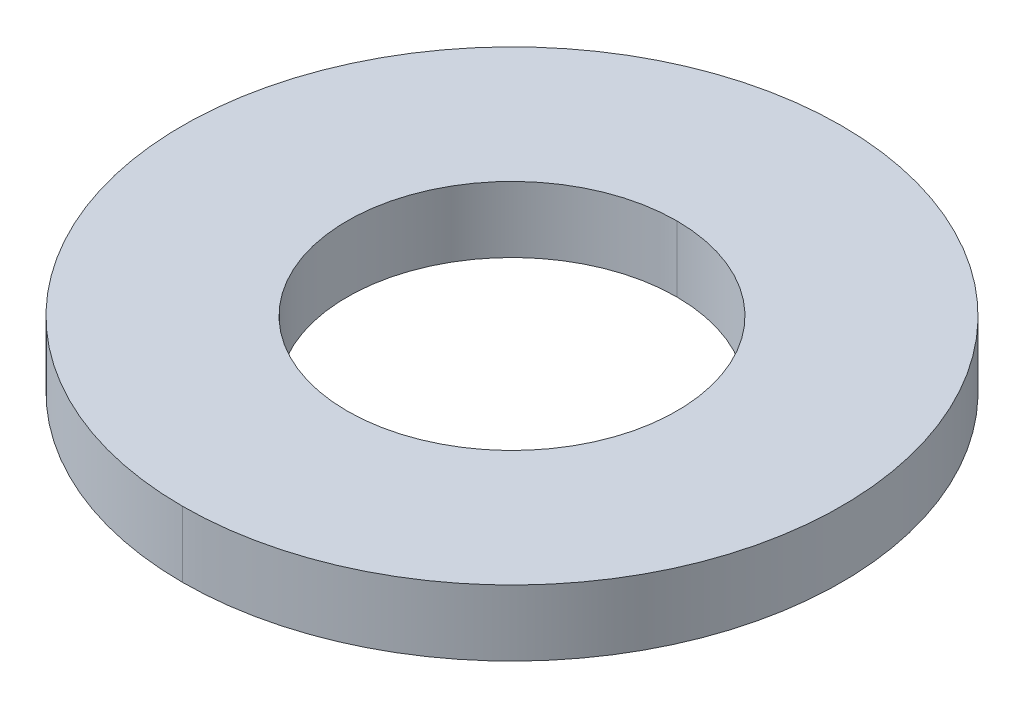
ISO-10303-21;
HEADER;
FILE_DESCRIPTION(('STEP AP214'),'2;1');
FILE_NAME('part.step','',(''),(''),'','','');
FILE_SCHEMA(('AUTOMOTIVE_DESIGN { 1 0 10303 214 1 1 1 1 }'));
ENDSEC;
DATA;
#1=APPLICATION_CONTEXT('core data for automotive mechanical design processes');
#2=APPLICATION_PROTOCOL_DEFINITION('international standard','automotive_design',2000,#1);
#3=PRODUCT_CONTEXT('',#1,'mechanical');
#4=PRODUCT('Part','Part','',(#3));
#5=PRODUCT_RELATED_PRODUCT_CATEGORY('part','',(#4));
#6=PRODUCT_DEFINITION_FORMATION('','',#4);
#7=PRODUCT_DEFINITION_CONTEXT('part definition',#1,'design');
#8=PRODUCT_DEFINITION('design','',#6,#7);
#9=PRODUCT_DEFINITION_SHAPE('','',#8);
#10=(LENGTH_UNIT() NAMED_UNIT(*) SI_UNIT(.MILLI.,.METRE.));
#11=(NAMED_UNIT(*) PLANE_ANGLE_UNIT() SI_UNIT($,.RADIAN.));
#12=(NAMED_UNIT(*) SI_UNIT($,.STERADIAN.) SOLID_ANGLE_UNIT());
#13=UNCERTAINTY_MEASURE_WITH_UNIT(LENGTH_MEASURE(1.E-05),#10,'distance_accuracy_value','');
#14=(GEOMETRIC_REPRESENTATION_CONTEXT(3) GLOBAL_UNCERTAINTY_ASSIGNED_CONTEXT((#13)) GLOBAL_UNIT_ASSIGNED_CONTEXT((#10,
#11,#12)) REPRESENTATION_CONTEXT('',''));
#15=CARTESIAN_POINT('',(0.,0.,0.));
#16=DIRECTION('',(0.,0.,1.));
#17=DIRECTION('',(1.,0.,0.));
#18=AXIS2_PLACEMENT_3D('',#15,#16,#17);
#19=CARTESIAN_POINT('',(0.,1.,0.));
#20=DIRECTION('',(0.,-1.,0.));
#21=DIRECTION('',(0.,0.,-1.));
#22=AXIS2_PLACEMENT_3D('',#19,#20,#21);
#23=CYLINDRICAL_SURFACE('',#22,2.5);
#24=DIRECTION('',(0.,-1.,0.));
#25=VECTOR('',#24,1.);
#26=CARTESIAN_POINT('',(0.,1.,2.5));
#27=LINE('',#26,#25);
#28=CARTESIAN_POINT('',(0.,1.,2.5));
#29=VERTEX_POINT('',#28);
#30=CARTESIAN_POINT('',(0.,0.,2.5));
#31=VERTEX_POINT('',#30);
#32=EDGE_CURVE('E100',#29,#31,#27,.T.);
#33=ORIENTED_EDGE('',*,*,#32,.F.);
#34=CARTESIAN_POINT('',(0.,1.,0.));
#35=DIRECTION('',(0.,1.,0.));
#36=DIRECTION('',(0.,0.,1.));
#37=AXIS2_PLACEMENT_3D('',#34,#35,#36);
#38=CIRCLE('',#37,2.5);
#39=CARTESIAN_POINT('',(0.,1.,-2.5));
#40=VERTEX_POINT('',#39);
#41=EDGE_CURVE('E76',#29,#40,#38,.T.);
#42=ORIENTED_EDGE('',*,*,#41,.T.);
#43=DIRECTION('',(0.,-1.,0.));
#44=VECTOR('',#43,1.);
#45=CARTESIAN_POINT('',(0.,1.,-2.5));
#46=LINE('',#45,#44);
#47=CARTESIAN_POINT('',(0.,0.,-2.5));
#48=VERTEX_POINT('',#47);
#49=EDGE_CURVE('E88',#40,#48,#46,.T.);
#50=ORIENTED_EDGE('',*,*,#49,.T.);
#51=CARTESIAN_POINT('',(0.,0.,0.));
#52=DIRECTION('',(0.,1.,0.));
#53=DIRECTION('',(0.,0.,1.));
#54=AXIS2_PLACEMENT_3D('',#51,#52,#53);
#55=CIRCLE('',#54,2.5);
#56=EDGE_CURVE('E10',#31,#48,#55,.T.);
#57=ORIENTED_EDGE('',*,*,#56,.F.);
#58=EDGE_LOOP('',(#33,#42,#50,#57));
#59=FACE_BOUND('',#58,.T.);
#60=ADVANCED_FACE('F15',(#59),#23,.F.);
#61=CARTESIAN_POINT('',(0.,1.,0.));
#62=DIRECTION('',(0.,-1.,0.));
#63=DIRECTION('',(0.,0.,-1.));
#64=AXIS2_PLACEMENT_3D('',#61,#62,#63);
#65=CYLINDRICAL_SURFACE('',#64,5.);
#66=DIRECTION('',(0.,-1.,0.));
#67=VECTOR('',#66,1.);
#68=CARTESIAN_POINT('',(0.,1.,5.));
#69=LINE('',#68,#67);
#70=CARTESIAN_POINT('',(0.,1.,5.));
#71=VERTEX_POINT('',#70);
#72=CARTESIAN_POINT('',(0.,0.,5.));
#73=VERTEX_POINT('',#72);
#74=EDGE_CURVE('E79',#71,#73,#69,.T.);
#75=ORIENTED_EDGE('',*,*,#74,.F.);
#76=CARTESIAN_POINT('',(0.,1.,0.));
#77=DIRECTION('',(0.,1.,0.));
#78=DIRECTION('',(0.,0.,1.));
#79=AXIS2_PLACEMENT_3D('',#76,#77,#78);
#80=CIRCLE('',#79,5.);
#81=CARTESIAN_POINT('',(0.,1.,-5.));
#82=VERTEX_POINT('',#81);
#83=EDGE_CURVE('E70',#82,#71,#80,.T.);
#84=ORIENTED_EDGE('',*,*,#83,.F.);
#85=DIRECTION('',(0.,-1.,0.));
#86=VECTOR('',#85,1.);
#87=CARTESIAN_POINT('',(0.,1.,-5.));
#88=LINE('',#87,#86);
#89=CARTESIAN_POINT('',(0.,0.,-5.));
#90=VERTEX_POINT('',#89);
#91=EDGE_CURVE('E19',#82,#90,#88,.T.);
#92=ORIENTED_EDGE('',*,*,#91,.T.);
#93=CARTESIAN_POINT('',(0.,0.,0.));
#94=DIRECTION('',(0.,1.,0.));
#95=DIRECTION('',(0.,0.,1.));
#96=AXIS2_PLACEMENT_3D('',#93,#94,#95);
#97=CIRCLE('',#96,5.);
#98=EDGE_CURVE('E25',#90,#73,#97,.T.);
#99=ORIENTED_EDGE('',*,*,#98,.T.);
#100=EDGE_LOOP('',(#75,#84,#92,#99));
#101=FACE_BOUND('',#100,.T.);
#102=ADVANCED_FACE('F80',(#101),#65,.T.);
#103=CARTESIAN_POINT('',(0.,0.,0.));
#104=DIRECTION('',(0.,1.,0.));
#105=DIRECTION('',(1.,0.,0.));
#106=AXIS2_PLACEMENT_3D('',#103,#104,#105);
#107=PLANE('',#106);
#108=CARTESIAN_POINT('',(0.,0.,0.));
#109=DIRECTION('',(0.,1.,0.));
#110=DIRECTION('',(0.,0.,1.));
#111=AXIS2_PLACEMENT_3D('',#108,#109,#110);
#112=CIRCLE('',#111,2.5);
#113=EDGE_CURVE('E96',#48,#31,#112,.T.);
#114=ORIENTED_EDGE('',*,*,#113,.T.);
#115=ORIENTED_EDGE('',*,*,#56,.T.);
#116=EDGE_LOOP('',(#114,#115));
#117=FACE_BOUND('',#116,.T.);
#118=ORIENTED_EDGE('',*,*,#98,.F.);
#119=CARTESIAN_POINT('',(0.,0.,0.));
#120=DIRECTION('',(0.,1.,0.));
#121=DIRECTION('',(0.,0.,1.));
#122=AXIS2_PLACEMENT_3D('',#119,#120,#121);
#123=CIRCLE('',#122,5.);
#124=EDGE_CURVE('E84',#73,#90,#123,.T.);
#125=ORIENTED_EDGE('',*,*,#124,.F.);
#126=EDGE_LOOP('',(#118,#125));
#127=FACE_BOUND('',#126,.T.);
#128=ADVANCED_FACE('F125',(#117,#127),#107,.F.);
#129=CARTESIAN_POINT('',(0.,1.,0.));
#130=DIRECTION('',(0.,1.,0.));
#131=DIRECTION('',(1.,0.,0.));
#132=AXIS2_PLACEMENT_3D('',#129,#130,#131);
#133=PLANE('',#132);
#134=CARTESIAN_POINT('',(0.,1.,0.));
#135=DIRECTION('',(0.,1.,0.));
#136=DIRECTION('',(0.,0.,1.));
#137=AXIS2_PLACEMENT_3D('',#134,#135,#136);
#138=CIRCLE('',#137,2.5);
#139=EDGE_CURVE('E105',#40,#29,#138,.T.);
#140=ORIENTED_EDGE('',*,*,#139,.F.);
#141=ORIENTED_EDGE('',*,*,#41,.F.);
#142=EDGE_LOOP('',(#140,#141));
#143=FACE_BOUND('',#142,.T.);
#144=ORIENTED_EDGE('',*,*,#83,.T.);
#145=CARTESIAN_POINT('',(0.,1.,0.));
#146=DIRECTION('',(0.,1.,0.));
#147=DIRECTION('',(0.,0.,1.));
#148=AXIS2_PLACEMENT_3D('',#145,#146,#147);
#149=CIRCLE('',#148,5.);
#150=EDGE_CURVE('E73',#71,#82,#149,.T.);
#151=ORIENTED_EDGE('',*,*,#150,.T.);
#152=EDGE_LOOP('',(#144,#151));
#153=FACE_BOUND('',#152,.T.);
#154=ADVANCED_FACE('F71',(#143,#153),#133,.T.);
#155=CARTESIAN_POINT('',(0.,1.,0.));
#156=DIRECTION('',(0.,-1.,0.));
#157=DIRECTION('',(0.,0.,-1.));
#158=AXIS2_PLACEMENT_3D('',#155,#156,#157);
#159=CYLINDRICAL_SURFACE('',#158,5.);
#160=ORIENTED_EDGE('',*,*,#150,.F.);
#161=ORIENTED_EDGE('',*,*,#74,.T.);
#162=ORIENTED_EDGE('',*,*,#124,.T.);
#163=ORIENTED_EDGE('',*,*,#91,.F.);
#164=EDGE_LOOP('',(#160,#161,#162,#163));
#165=FACE_BOUND('',#164,.T.);
#166=ADVANCED_FACE('F86',(#165),#159,.T.);
#167=CARTESIAN_POINT('',(0.,1.,0.));
#168=DIRECTION('',(0.,-1.,0.));
#169=DIRECTION('',(0.,0.,-1.));
#170=AXIS2_PLACEMENT_3D('',#167,#168,#169);
#171=CYLINDRICAL_SURFACE('',#170,2.5);
#172=ORIENTED_EDGE('',*,*,#139,.T.);
#173=ORIENTED_EDGE('',*,*,#32,.T.);
#174=ORIENTED_EDGE('',*,*,#113,.F.);
#175=ORIENTED_EDGE('',*,*,#49,.F.);
#176=EDGE_LOOP('',(#172,#173,#174,#175));
#177=FACE_BOUND('',#176,.T.);
#178=ADVANCED_FACE('F17',(#177),#171,.F.);
#179=CLOSED_SHELL('',(#60,#102,#128,#154,#166,#178));
#180=MANIFOLD_SOLID_BREP('B1',#179);
#181=ADVANCED_BREP_SHAPE_REPRESENTATION('',(#18,#180),#14);
#182=SHAPE_DEFINITION_REPRESENTATION(#9,#181);
ENDSEC;
END-ISO-10303-21;
